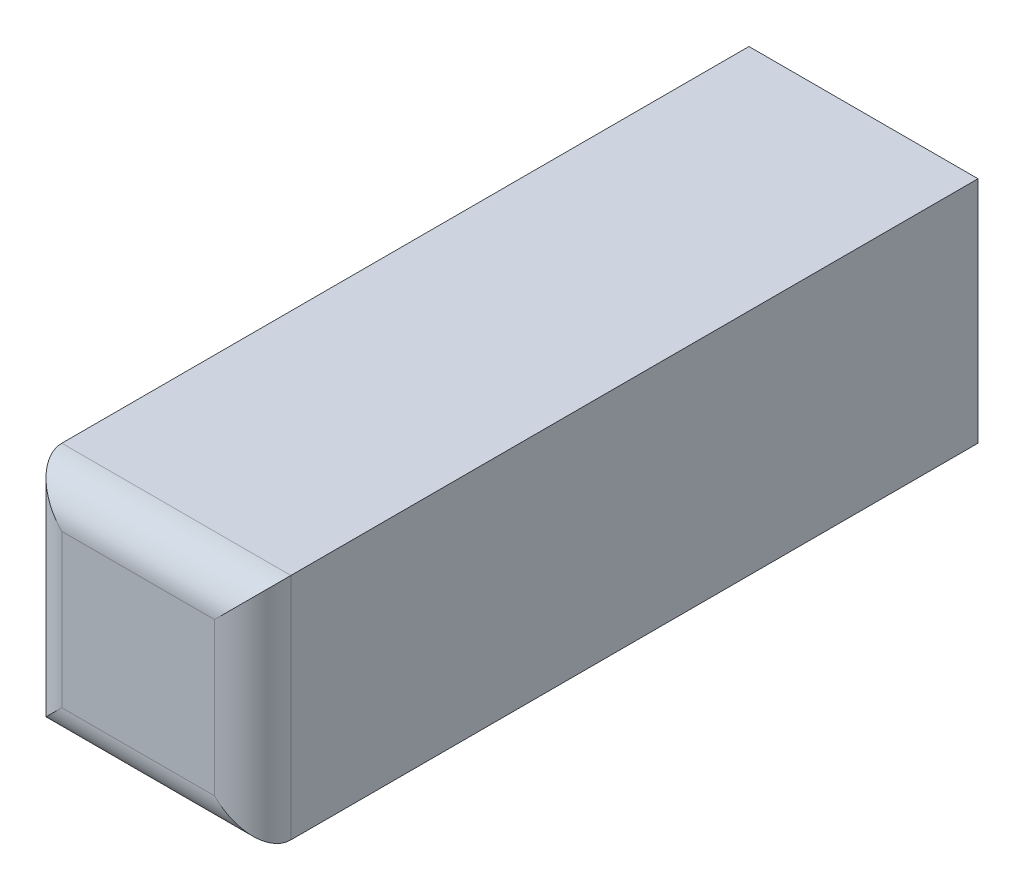
ISO-10303-21;
HEADER;
FILE_DESCRIPTION(('STEP AP214'),'2;1');
FILE_NAME('part.step','',(''),(''),'','','');
FILE_SCHEMA(('AUTOMOTIVE_DESIGN { 1 0 10303 214 1 1 1 1 }'));
ENDSEC;
DATA;
#1=APPLICATION_CONTEXT('core data for automotive mechanical design processes');
#2=APPLICATION_PROTOCOL_DEFINITION('international standard','automotive_design',2000,#1);
#3=PRODUCT_CONTEXT('',#1,'mechanical');
#4=PRODUCT('Part','Part','',(#3));
#5=PRODUCT_RELATED_PRODUCT_CATEGORY('part','',(#4));
#6=PRODUCT_DEFINITION_FORMATION('','',#4);
#7=PRODUCT_DEFINITION_CONTEXT('part definition',#1,'design');
#8=PRODUCT_DEFINITION('design','',#6,#7);
#9=PRODUCT_DEFINITION_SHAPE('','',#8);
#10=(LENGTH_UNIT() NAMED_UNIT(*) SI_UNIT(.MILLI.,.METRE.));
#11=(NAMED_UNIT(*) PLANE_ANGLE_UNIT() SI_UNIT($,.RADIAN.));
#12=(NAMED_UNIT(*) SI_UNIT($,.STERADIAN.) SOLID_ANGLE_UNIT());
#13=UNCERTAINTY_MEASURE_WITH_UNIT(LENGTH_MEASURE(1.E-05),#10,'distance_accuracy_value','');
#14=(GEOMETRIC_REPRESENTATION_CONTEXT(3) GLOBAL_UNCERTAINTY_ASSIGNED_CONTEXT((#13)) GLOBAL_UNIT_ASSIGNED_CONTEXT((#10,
#11,#12)) REPRESENTATION_CONTEXT('',''));
#15=CARTESIAN_POINT('',(0.,0.,0.));
#16=DIRECTION('',(0.,0.,1.));
#17=DIRECTION('',(1.,0.,0.));
#18=AXIS2_PLACEMENT_3D('',#15,#16,#17);
#19=CARTESIAN_POINT('',(-3.,-3.00000000000001,19.));
#20=DIRECTION('',(1.,0.,0.));
#21=DIRECTION('',(0.,1.,0.));
#22=AXIS2_PLACEMENT_3D('',#19,#20,#21);
#23=PLANE('',#22);
#24=DIRECTION('',(0.,0.,-1.));
#25=VECTOR('',#24,1.);
#26=CARTESIAN_POINT('',(-3.,-3.00000000000001,19.));
#27=LINE('',#26,#25);
#28=CARTESIAN_POINT('',(-3.,-3.00000000000001,18.));
#29=VERTEX_POINT('',#28);
#30=CARTESIAN_POINT('',(-3.,-3.00000000000001,0.));
#31=VERTEX_POINT('',#30);
#32=EDGE_CURVE('E94',#29,#31,#27,.T.);
#33=ORIENTED_EDGE('',*,*,#32,.F.);
#34=DIRECTION('',(0.,-1.,0.));
#35=VECTOR('',#34,1.);
#36=CARTESIAN_POINT('',(-2.99999999999999,2.99999999999999,18.));
#37=LINE('',#36,#35);
#38=CARTESIAN_POINT('',(-2.99999999999999,2.99999999999999,18.));
#39=VERTEX_POINT('',#38);
#40=EDGE_CURVE('E64',#29,#39,#37,.F.);
#41=ORIENTED_EDGE('',*,*,#40,.T.);
#42=DIRECTION('',(0.,0.,-1.));
#43=VECTOR('',#42,1.);
#44=CARTESIAN_POINT('',(-2.99999999999999,2.99999999999999,19.));
#45=LINE('',#44,#43);
#46=CARTESIAN_POINT('',(-2.99999999999999,2.99999999999999,0.));
#47=VERTEX_POINT('',#46);
#48=EDGE_CURVE('E116',#39,#47,#45,.T.);
#49=ORIENTED_EDGE('',*,*,#48,.T.);
#50=DIRECTION('',(0.,-1.,0.));
#51=VECTOR('',#50,1.);
#52=CARTESIAN_POINT('',(-3.,-3.00000000000001,0.));
#53=LINE('',#52,#51);
#54=EDGE_CURVE('E111',#47,#31,#53,.T.);
#55=ORIENTED_EDGE('',*,*,#54,.T.);
#56=EDGE_LOOP('',(#33,#41,#49,#55));
#57=FACE_BOUND('',#56,.T.);
#58=ADVANCED_FACE('F39',(#57),#23,.F.);
#59=CARTESIAN_POINT('',(2.99999999999999,-2.99999999999999,19.));
#60=DIRECTION('',(0.,1.,0.));
#61=DIRECTION('',(-1.,0.,0.));
#62=AXIS2_PLACEMENT_3D('',#59,#60,#61);
#63=PLANE('',#62);
#64=DIRECTION('',(0.,0.,-1.));
#65=VECTOR('',#64,1.);
#66=CARTESIAN_POINT('',(2.99999999999999,-2.99999999999999,19.));
#67=LINE('',#66,#65);
#68=CARTESIAN_POINT('',(2.99999999999999,-2.99999999999999,18.));
#69=VERTEX_POINT('',#68);
#70=CARTESIAN_POINT('',(2.99999999999999,-2.99999999999999,0.));
#71=VERTEX_POINT('',#70);
#72=EDGE_CURVE('E105',#69,#71,#67,.T.);
#73=ORIENTED_EDGE('',*,*,#72,.F.);
#74=DIRECTION('',(1.,0.,0.));
#75=VECTOR('',#74,1.);
#76=CARTESIAN_POINT('',(-3.,-3.00000000000001,18.));
#77=LINE('',#76,#75);
#78=EDGE_CURVE('E101',#69,#29,#77,.F.);
#79=ORIENTED_EDGE('',*,*,#78,.T.);
#80=ORIENTED_EDGE('',*,*,#32,.T.);
#81=DIRECTION('',(1.,0.,0.));
#82=VECTOR('',#81,1.);
#83=CARTESIAN_POINT('',(2.99999999999999,-2.99999999999999,0.));
#84=LINE('',#83,#82);
#85=EDGE_CURVE('E98',#31,#71,#84,.T.);
#86=ORIENTED_EDGE('',*,*,#85,.T.);
#87=EDGE_LOOP('',(#73,#79,#80,#86));
#88=FACE_BOUND('',#87,.T.);
#89=ADVANCED_FACE('F97',(#88),#63,.F.);
#90=CARTESIAN_POINT('',(2.99999999999999,-2.99999999999999,19.));
#91=DIRECTION('',(-1.,0.,0.));
#92=DIRECTION('',(0.,-1.,0.));
#93=AXIS2_PLACEMENT_3D('',#90,#91,#92);
#94=PLANE('',#93);
#95=DIRECTION('',(0.,0.,-1.));
#96=VECTOR('',#95,1.);
#97=CARTESIAN_POINT('',(3.00000000000001,3.00000000000001,19.));
#98=LINE('',#97,#96);
#99=CARTESIAN_POINT('',(3.00000000000001,3.00000000000001,18.));
#100=VERTEX_POINT('',#99);
#101=CARTESIAN_POINT('',(3.00000000000001,3.00000000000001,0.));
#102=VERTEX_POINT('',#101);
#103=EDGE_CURVE('E134',#100,#102,#98,.T.);
#104=ORIENTED_EDGE('',*,*,#103,.F.);
#105=DIRECTION('',(0.,1.,0.));
#106=VECTOR('',#105,1.);
#107=CARTESIAN_POINT('',(2.99999999999999,-2.99999999999999,18.));
#108=LINE('',#107,#106);
#109=EDGE_CURVE('E11',#100,#69,#108,.F.);
#110=ORIENTED_EDGE('',*,*,#109,.T.);
#111=ORIENTED_EDGE('',*,*,#72,.T.);
#112=DIRECTION('',(0.,1.,0.));
#113=VECTOR('',#112,1.);
#114=CARTESIAN_POINT('',(2.99999999999999,-2.99999999999999,0.));
#115=LINE('',#114,#113);
#116=EDGE_CURVE('E113',#71,#102,#115,.T.);
#117=ORIENTED_EDGE('',*,*,#116,.T.);
#118=EDGE_LOOP('',(#104,#110,#111,#117));
#119=FACE_BOUND('',#118,.T.);
#120=ADVANCED_FACE('F199',(#119),#94,.F.);
#121=CARTESIAN_POINT('',(3.00000000000001,3.00000000000001,19.));
#122=DIRECTION('',(0.,-1.,0.));
#123=DIRECTION('',(1.,0.,0.));
#124=AXIS2_PLACEMENT_3D('',#121,#122,#123);
#125=PLANE('',#124);
#126=ORIENTED_EDGE('',*,*,#48,.F.);
#127=DIRECTION('',(-1.,0.,0.));
#128=VECTOR('',#127,1.);
#129=CARTESIAN_POINT('',(3.00000000000001,3.00000000000001,18.));
#130=LINE('',#129,#128);
#131=EDGE_CURVE('E49',#39,#100,#130,.F.);
#132=ORIENTED_EDGE('',*,*,#131,.T.);
#133=ORIENTED_EDGE('',*,*,#103,.T.);
#134=DIRECTION('',(-1.,0.,0.));
#135=VECTOR('',#134,1.);
#136=CARTESIAN_POINT('',(3.00000000000001,3.00000000000001,0.));
#137=LINE('',#136,#135);
#138=EDGE_CURVE('E129',#102,#47,#137,.T.);
#139=ORIENTED_EDGE('',*,*,#138,.T.);
#140=EDGE_LOOP('',(#126,#132,#133,#139));
#141=FACE_BOUND('',#140,.T.);
#142=ADVANCED_FACE('F190',(#141),#125,.F.);
#143=CARTESIAN_POINT('',(0.,0.,19.));
#144=DIRECTION('',(0.,0.,1.));
#145=DIRECTION('',(1.,0.,0.));
#146=AXIS2_PLACEMENT_3D('',#143,#144,#145);
#147=PLANE('',#146);
#148=DIRECTION('',(0.,-1.,0.));
#149=VECTOR('',#148,1.);
#150=CARTESIAN_POINT('',(-2.,-3.00000000000001,19.));
#151=LINE('',#150,#149);
#152=CARTESIAN_POINT('',(-2.,2.,19.));
#153=VERTEX_POINT('',#152);
#154=CARTESIAN_POINT('',(-2.,-2.,19.));
#155=VERTEX_POINT('',#154);
#156=EDGE_CURVE('E144',#153,#155,#151,.T.);
#157=ORIENTED_EDGE('',*,*,#156,.T.);
#158=DIRECTION('',(1.,0.,0.));
#159=VECTOR('',#158,1.);
#160=CARTESIAN_POINT('',(2.99999999999999,-1.99999999999999,19.));
#161=LINE('',#160,#159);
#162=CARTESIAN_POINT('',(2.,-2.,19.));
#163=VERTEX_POINT('',#162);
#164=EDGE_CURVE('E147',#155,#163,#161,.T.);
#165=ORIENTED_EDGE('',*,*,#164,.T.);
#166=DIRECTION('',(0.,1.,0.));
#167=VECTOR('',#166,1.);
#168=CARTESIAN_POINT('',(2.00000000000001,3.00000000000001,19.));
#169=LINE('',#168,#167);
#170=CARTESIAN_POINT('',(2.,2.,19.));
#171=VERTEX_POINT('',#170);
#172=EDGE_CURVE('E104',#163,#171,#169,.T.);
#173=ORIENTED_EDGE('',*,*,#172,.T.);
#174=DIRECTION('',(-1.,0.,0.));
#175=VECTOR('',#174,1.);
#176=CARTESIAN_POINT('',(-2.99999999999999,1.99999999999999,19.));
#177=LINE('',#176,#175);
#178=EDGE_CURVE('E141',#171,#153,#177,.T.);
#179=ORIENTED_EDGE('',*,*,#178,.T.);
#180=EDGE_LOOP('',(#157,#165,#173,#179));
#181=FACE_BOUND('',#180,.T.);
#182=ADVANCED_FACE('F181',(#181),#147,.T.);
#183=CARTESIAN_POINT('',(0.,0.,0.));
#184=DIRECTION('',(0.,0.,1.));
#185=DIRECTION('',(1.,0.,0.));
#186=AXIS2_PLACEMENT_3D('',#183,#184,#185);
#187=PLANE('',#186);
#188=CARTESIAN_POINT('',(0.,0.,0.));
#189=DIRECTION('',(0.,0.,-1.));
#190=DIRECTION('',(-1.,0.,0.));
#191=AXIS2_PLACEMENT_3D('',#188,#189,#190);
#192=CIRCLE('',#191,1.8);
#193=CARTESIAN_POINT('',(-1.8,0.,0.));
#194=VERTEX_POINT('',#193);
#195=EDGE_CURVE('E123',#194,#194,#192,.T.);
#196=ORIENTED_EDGE('',*,*,#195,.F.);
#197=EDGE_LOOP('',(#196));
#198=FACE_BOUND('',#197,.T.);
#199=ORIENTED_EDGE('',*,*,#54,.F.);
#200=ORIENTED_EDGE('',*,*,#138,.F.);
#201=ORIENTED_EDGE('',*,*,#116,.F.);
#202=ORIENTED_EDGE('',*,*,#85,.F.);
#203=EDGE_LOOP('',(#199,#200,#201,#202));
#204=FACE_BOUND('',#203,.T.);
#205=ADVANCED_FACE('F109',(#198,#204),#187,.F.);
#206=CARTESIAN_POINT('',(0.,0.,5.));
#207=DIRECTION('',(0.,0.,-1.));
#208=DIRECTION('',(-1.,0.,0.));
#209=AXIS2_PLACEMENT_3D('',#206,#207,#208);
#210=CYLINDRICAL_SURFACE('',#209,1.8);
#211=CARTESIAN_POINT('',(0.,0.,5.));
#212=DIRECTION('',(0.,0.,-1.));
#213=DIRECTION('',(-1.,0.,0.));
#214=AXIS2_PLACEMENT_3D('',#211,#212,#213);
#215=CIRCLE('',#214,1.8);
#216=CARTESIAN_POINT('',(-1.8,0.,5.));
#217=VERTEX_POINT('',#216);
#218=EDGE_CURVE('E119',#217,#217,#215,.T.);
#219=ORIENTED_EDGE('',*,*,#218,.F.);
#220=EDGE_LOOP('',(#219));
#221=FACE_BOUND('',#220,.T.);
#222=ORIENTED_EDGE('',*,*,#195,.T.);
#223=EDGE_LOOP('',(#222));
#224=FACE_BOUND('',#223,.T.);
#225=ADVANCED_FACE('F178',(#221,#224),#210,.F.);
#226=CARTESIAN_POINT('',(0.,0.,5.));
#227=DIRECTION('',(0.,0.,-1.));
#228=DIRECTION('',(-1.,0.,0.));
#229=AXIS2_PLACEMENT_3D('',#226,#227,#228);
#230=PLANE('',#229);
#231=ORIENTED_EDGE('',*,*,#218,.T.);
#232=EDGE_LOOP('',(#231));
#233=FACE_BOUND('',#232,.T.);
#234=ADVANCED_FACE('F187',(#233),#230,.T.);
#235=CARTESIAN_POINT('',(0.,2.,18.));
#236=DIRECTION('',(1.,0.,0.));
#237=DIRECTION('',(0.,1.,0.));
#238=AXIS2_PLACEMENT_3D('',#235,#236,#237);
#239=CYLINDRICAL_SURFACE('',#238,1.);
#240=CARTESIAN_POINT('',(2.,2.,18.));
#241=DIRECTION('',(0.707106781186548,-0.707106781186547,0.));
#242=DIRECTION('',(-0.707106781186547,-0.707106781186548,0.));
#243=AXIS2_PLACEMENT_3D('',#240,#241,#242);
#244=ELLIPSE('',#243,1.4142135623731,1.);
#245=EDGE_CURVE('E162',#100,#171,#244,.T.);
#246=ORIENTED_EDGE('',*,*,#245,.F.);
#247=ORIENTED_EDGE('',*,*,#131,.F.);
#248=CARTESIAN_POINT('',(-2.,2.,18.));
#249=DIRECTION('',(0.707106781186547,0.707106781186548,0.));
#250=DIRECTION('',(0.707106781186548,-0.707106781186547,0.));
#251=AXIS2_PLACEMENT_3D('',#248,#249,#250);
#252=ELLIPSE('',#251,1.41421356237309,1.);
#253=EDGE_CURVE('E43',#153,#39,#252,.F.);
#254=ORIENTED_EDGE('',*,*,#253,.F.);
#255=ORIENTED_EDGE('',*,*,#178,.F.);
#256=EDGE_LOOP('',(#246,#247,#254,#255));
#257=FACE_BOUND('',#256,.T.);
#258=ADVANCED_FACE('F41',(#257),#239,.T.);
#259=CARTESIAN_POINT('',(-2.,0.,18.));
#260=DIRECTION('',(0.,1.,0.));
#261=DIRECTION('',(-1.,0.,0.));
#262=AXIS2_PLACEMENT_3D('',#259,#260,#261);
#263=CYLINDRICAL_SURFACE('',#262,1.);
#264=ORIENTED_EDGE('',*,*,#253,.T.);
#265=ORIENTED_EDGE('',*,*,#40,.F.);
#266=CARTESIAN_POINT('',(-2.,-2.,18.));
#267=DIRECTION('',(-0.707106781186548,0.707106781186547,0.));
#268=DIRECTION('',(0.707106781186547,0.707106781186548,0.));
#269=AXIS2_PLACEMENT_3D('',#266,#267,#268);
#270=ELLIPSE('',#269,1.4142135623731,1.);
#271=EDGE_CURVE('E160',#155,#29,#270,.F.);
#272=ORIENTED_EDGE('',*,*,#271,.F.);
#273=ORIENTED_EDGE('',*,*,#156,.F.);
#274=EDGE_LOOP('',(#264,#265,#272,#273));
#275=FACE_BOUND('',#274,.T.);
#276=ADVANCED_FACE('F209',(#275),#263,.T.);
#277=CARTESIAN_POINT('',(2.,0.,18.));
#278=DIRECTION('',(0.,-1.,0.));
#279=DIRECTION('',(1.,0.,0.));
#280=AXIS2_PLACEMENT_3D('',#277,#278,#279);
#281=CYLINDRICAL_SURFACE('',#280,1.);
#282=ORIENTED_EDGE('',*,*,#245,.T.);
#283=ORIENTED_EDGE('',*,*,#172,.F.);
#284=CARTESIAN_POINT('',(2.,-1.99999999999999,18.));
#285=DIRECTION('',(-0.707106781186547,-0.707106781186548,0.));
#286=DIRECTION('',(0.707106781186548,-0.707106781186547,0.));
#287=AXIS2_PLACEMENT_3D('',#284,#285,#286);
#288=ELLIPSE('',#287,1.41421356237309,1.);
#289=EDGE_CURVE('E157',#69,#163,#288,.T.);
#290=ORIENTED_EDGE('',*,*,#289,.F.);
#291=ORIENTED_EDGE('',*,*,#109,.F.);
#292=EDGE_LOOP('',(#282,#283,#290,#291));
#293=FACE_BOUND('',#292,.T.);
#294=ADVANCED_FACE('F206',(#293),#281,.T.);
#295=CARTESIAN_POINT('',(0.,-2.,18.));
#296=DIRECTION('',(-1.,0.,0.));
#297=DIRECTION('',(0.,-1.,0.));
#298=AXIS2_PLACEMENT_3D('',#295,#296,#297);
#299=CYLINDRICAL_SURFACE('',#298,1.);
#300=ORIENTED_EDGE('',*,*,#271,.T.);
#301=ORIENTED_EDGE('',*,*,#78,.F.);
#302=ORIENTED_EDGE('',*,*,#289,.T.);
#303=ORIENTED_EDGE('',*,*,#164,.F.);
#304=EDGE_LOOP('',(#300,#301,#302,#303));
#305=FACE_BOUND('',#304,.T.);
#306=ADVANCED_FACE('F203',(#305),#299,.T.);
#307=CLOSED_SHELL('',(#58,#89,#120,#142,#182,#205,#225,#234,#258,#276,#294,#306));
#308=MANIFOLD_SOLID_BREP('B2',#307);
#309=ADVANCED_BREP_SHAPE_REPRESENTATION('',(#18,#308),#14);
#310=SHAPE_DEFINITION_REPRESENTATION(#9,#309);
ENDSEC;
END-ISO-10303-21;
